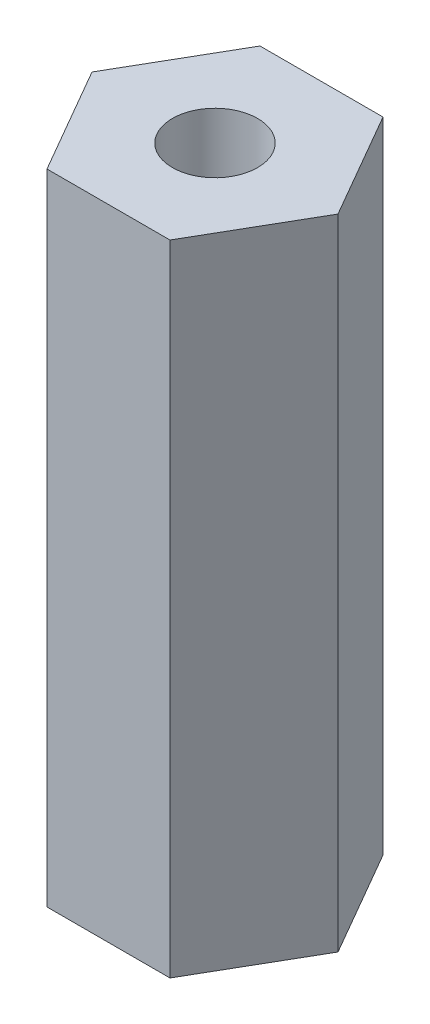
ISO-10303-21;
HEADER;
FILE_DESCRIPTION(('STEP AP214'),'2;1');
FILE_NAME('part.step','',(''),(''),'','','');
FILE_SCHEMA(('AUTOMOTIVE_DESIGN { 1 0 10303 214 1 1 1 1 }'));
ENDSEC;
DATA;
#1=APPLICATION_CONTEXT('core data for automotive mechanical design processes');
#2=APPLICATION_PROTOCOL_DEFINITION('international standard','automotive_design',2000,#1);
#3=PRODUCT_CONTEXT('',#1,'mechanical');
#4=PRODUCT('Part','Part','',(#3));
#5=PRODUCT_RELATED_PRODUCT_CATEGORY('part','',(#4));
#6=PRODUCT_DEFINITION_FORMATION('','',#4);
#7=PRODUCT_DEFINITION_CONTEXT('part definition',#1,'design');
#8=PRODUCT_DEFINITION('design','',#6,#7);
#9=PRODUCT_DEFINITION_SHAPE('','',#8);
#10=(LENGTH_UNIT() NAMED_UNIT(*) SI_UNIT(.MILLI.,.METRE.));
#11=(NAMED_UNIT(*) PLANE_ANGLE_UNIT() SI_UNIT($,.RADIAN.));
#12=(NAMED_UNIT(*) SI_UNIT($,.STERADIAN.) SOLID_ANGLE_UNIT());
#13=UNCERTAINTY_MEASURE_WITH_UNIT(LENGTH_MEASURE(1.E-05),#10,'distance_accuracy_value','');
#14=(GEOMETRIC_REPRESENTATION_CONTEXT(3) GLOBAL_UNCERTAINTY_ASSIGNED_CONTEXT((#13)) GLOBAL_UNIT_ASSIGNED_CONTEXT((#10,
#11,#12)) REPRESENTATION_CONTEXT('',''));
#15=CARTESIAN_POINT('',(0.,0.,0.));
#16=DIRECTION('',(0.,0.,1.));
#17=DIRECTION('',(1.,0.,0.));
#18=AXIS2_PLACEMENT_3D('',#15,#16,#17);
#19=CARTESIAN_POINT('',(1.443375673,15.,2.5));
#20=DIRECTION('',(-0.866025403838329,0.,-0.499999999906659));
#21=DIRECTION('',(-0.499999999906659,0.,0.866025403838329));
#22=AXIS2_PLACEMENT_3D('',#19,#20,#21);
#23=PLANE('',#22);
#24=DIRECTION('',(0.500000000006738,0.,-0.866025403780548));
#25=VECTOR('',#24,1.);
#26=CARTESIAN_POINT('',(1.443375673,15.,2.5));
#27=LINE('',#26,#25);
#28=CARTESIAN_POINT('',(1.443375673,15.,2.5));
#29=VERTEX_POINT('',#28);
#30=CARTESIAN_POINT('',(2.88675134585555,15.,-8.33995045868235E-11));
#31=VERTEX_POINT('',#30);
#32=EDGE_CURVE('E64',#29,#31,#27,.T.);
#33=ORIENTED_EDGE('',*,*,#32,.F.);
#34=DIRECTION('',(0.,1.,0.));
#35=VECTOR('',#34,1.);
#36=CARTESIAN_POINT('',(1.443375673,15.,2.5));
#37=LINE('',#36,#35);
#38=CARTESIAN_POINT('',(1.443375673,0.,2.5));
#39=VERTEX_POINT('',#38);
#40=EDGE_CURVE('E96',#39,#29,#37,.T.);
#41=ORIENTED_EDGE('',*,*,#40,.F.);
#42=DIRECTION('',(-0.500000000006738,0.,0.866025403780548));
#43=VECTOR('',#42,1.);
#44=CARTESIAN_POINT('',(2.886751346,0.,0.));
#45=LINE('',#44,#43);
#46=CARTESIAN_POINT('',(2.88675134585555,0.,-8.33993789826903E-11));
#47=VERTEX_POINT('',#46);
#48=EDGE_CURVE('E70',#47,#39,#45,.T.);
#49=ORIENTED_EDGE('',*,*,#48,.F.);
#50=DIRECTION('',(0.,1.,0.));
#51=VECTOR('',#50,1.);
#52=CARTESIAN_POINT('',(2.886751346,15.,0.));
#53=LINE('',#52,#51);
#54=EDGE_CURVE('E67',#31,#47,#53,.F.);
#55=ORIENTED_EDGE('',*,*,#54,.F.);
#56=EDGE_LOOP('',(#33,#41,#49,#55));
#57=FACE_BOUND('',#56,.T.);
#58=ADVANCED_FACE('F16',(#57),#23,.F.);
#59=CARTESIAN_POINT('',(-1.443375673,15.,2.5));
#60=DIRECTION('',(0.,0.,-1.));
#61=DIRECTION('',(-1.,0.,0.));
#62=AXIS2_PLACEMENT_3D('',#59,#60,#61);
#63=PLANE('',#62);
#64=DIRECTION('',(1.,0.,0.));
#65=VECTOR('',#64,1.);
#66=CARTESIAN_POINT('',(0.,15.,2.5));
#67=LINE('',#66,#65);
#68=CARTESIAN_POINT('',(-1.44337567314445,15.,2.5000000000834));
#69=VERTEX_POINT('',#68);
#70=EDGE_CURVE('E85',#69,#29,#67,.T.);
#71=ORIENTED_EDGE('',*,*,#70,.F.);
#72=DIRECTION('',(0.,1.,0.));
#73=VECTOR('',#72,1.);
#74=CARTESIAN_POINT('',(-1.4433756732889,15.,2.5000000001668));
#75=LINE('',#74,#73);
#76=CARTESIAN_POINT('',(-1.44337567307223,0.,2.5000000000417));
#77=VERTEX_POINT('',#76);
#78=EDGE_CURVE('E94',#77,#69,#75,.T.);
#79=ORIENTED_EDGE('',*,*,#78,.F.);
#80=DIRECTION('',(1.,0.,0.));
#81=VECTOR('',#80,1.);
#82=CARTESIAN_POINT('',(0.,0.,2.5));
#83=LINE('',#82,#81);
#84=EDGE_CURVE('E101',#39,#77,#83,.F.);
#85=ORIENTED_EDGE('',*,*,#84,.F.);
#86=ORIENTED_EDGE('',*,*,#40,.T.);
#87=EDGE_LOOP('',(#71,#79,#85,#86));
#88=FACE_BOUND('',#87,.T.);
#89=ADVANCED_FACE('F99',(#88),#63,.F.);
#90=CARTESIAN_POINT('',(-2.886751346,15.,0.));
#91=DIRECTION('',(0.866025403838329,0.,-0.499999999906659));
#92=DIRECTION('',(-0.499999999906659,0.,-0.866025403838329));
#93=AXIS2_PLACEMENT_3D('',#90,#91,#92);
#94=PLANE('',#93);
#95=DIRECTION('',(0.500000000006738,0.,0.866025403780548));
#96=VECTOR('',#95,1.);
#97=CARTESIAN_POINT('',(-2.886751346,15.,0.));
#98=LINE('',#97,#96);
#99=CARTESIAN_POINT('',(-2.88675134585555,15.,8.33995045868235E-11));
#100=VERTEX_POINT('',#99);
#101=EDGE_CURVE('E111',#100,#69,#98,.T.);
#102=ORIENTED_EDGE('',*,*,#101,.F.);
#103=DIRECTION('',(0.,1.,0.));
#104=VECTOR('',#103,1.);
#105=CARTESIAN_POINT('',(-2.8867513457111,15.,1.66798866385598E-10));
#106=LINE('',#105,#104);
#107=CARTESIAN_POINT('',(-2.88675134592777,0.,4.16996623862909E-11));
#108=VERTEX_POINT('',#107);
#109=EDGE_CURVE('E92',#108,#100,#106,.T.);
#110=ORIENTED_EDGE('',*,*,#109,.F.);
#111=DIRECTION('',(-0.500000000006738,0.,-0.866025403780548));
#112=VECTOR('',#111,1.);
#113=CARTESIAN_POINT('',(-1.443375673,0.,2.5));
#114=LINE('',#113,#112);
#115=EDGE_CURVE('E105',#77,#108,#114,.T.);
#116=ORIENTED_EDGE('',*,*,#115,.F.);
#117=ORIENTED_EDGE('',*,*,#78,.T.);
#118=EDGE_LOOP('',(#102,#110,#116,#117));
#119=FACE_BOUND('',#118,.T.);
#120=ADVANCED_FACE('F128',(#119),#94,.F.);
#121=CARTESIAN_POINT('',(-1.443375673,15.,-2.5));
#122=DIRECTION('',(0.866025403838329,0.,0.499999999906659));
#123=DIRECTION('',(0.499999999906659,0.,-0.866025403838329));
#124=AXIS2_PLACEMENT_3D('',#121,#122,#123);
#125=PLANE('',#124);
#126=DIRECTION('',(-0.500000000006738,0.,0.866025403780548));
#127=VECTOR('',#126,1.);
#128=CARTESIAN_POINT('',(-1.443375673,15.,-2.5));
#129=LINE('',#128,#127);
#130=CARTESIAN_POINT('',(-1.443375673,15.,-2.5));
#131=VERTEX_POINT('',#130);
#132=EDGE_CURVE('E116',#131,#100,#129,.T.);
#133=ORIENTED_EDGE('',*,*,#132,.F.);
#134=DIRECTION('',(0.,1.,0.));
#135=VECTOR('',#134,1.);
#136=CARTESIAN_POINT('',(-1.443375673,15.,-2.5));
#137=LINE('',#136,#135);
#138=CARTESIAN_POINT('',(-1.443375673,0.,-2.5));
#139=VERTEX_POINT('',#138);
#140=EDGE_CURVE('E90',#139,#131,#137,.T.);
#141=ORIENTED_EDGE('',*,*,#140,.F.);
#142=DIRECTION('',(0.500000000006738,0.,-0.866025403780548));
#143=VECTOR('',#142,1.);
#144=CARTESIAN_POINT('',(-2.886751346,0.,0.));
#145=LINE('',#144,#143);
#146=EDGE_CURVE('E126',#108,#139,#145,.T.);
#147=ORIENTED_EDGE('',*,*,#146,.F.);
#148=ORIENTED_EDGE('',*,*,#109,.T.);
#149=EDGE_LOOP('',(#133,#141,#147,#148));
#150=FACE_BOUND('',#149,.T.);
#151=ADVANCED_FACE('F124',(#150),#125,.F.);
#152=CARTESIAN_POINT('',(1.443375673,15.,-2.5));
#153=DIRECTION('',(0.,0.,1.));
#154=DIRECTION('',(1.,0.,0.));
#155=AXIS2_PLACEMENT_3D('',#152,#153,#154);
#156=PLANE('',#155);
#157=DIRECTION('',(1.,0.,0.));
#158=VECTOR('',#157,1.);
#159=CARTESIAN_POINT('',(0.,15.,-2.5));
#160=LINE('',#159,#158);
#161=CARTESIAN_POINT('',(1.44337567314445,15.,-2.5000000000834));
#162=VERTEX_POINT('',#161);
#163=EDGE_CURVE('E79',#162,#131,#160,.F.);
#164=ORIENTED_EDGE('',*,*,#163,.F.);
#165=DIRECTION('',(0.,1.,0.));
#166=VECTOR('',#165,1.);
#167=CARTESIAN_POINT('',(1.4433756732889,15.,-2.5000000001668));
#168=LINE('',#167,#166);
#169=CARTESIAN_POINT('',(1.44337567307223,0.,-2.5000000000417));
#170=VERTEX_POINT('',#169);
#171=EDGE_CURVE('E32',#170,#162,#168,.T.);
#172=ORIENTED_EDGE('',*,*,#171,.F.);
#173=DIRECTION('',(1.,0.,0.));
#174=VECTOR('',#173,1.);
#175=CARTESIAN_POINT('',(0.,0.,-2.5));
#176=LINE('',#175,#174);
#177=EDGE_CURVE('E120',#139,#170,#176,.T.);
#178=ORIENTED_EDGE('',*,*,#177,.F.);
#179=ORIENTED_EDGE('',*,*,#140,.T.);
#180=EDGE_LOOP('',(#164,#172,#178,#179));
#181=FACE_BOUND('',#180,.T.);
#182=ADVANCED_FACE('F119',(#181),#156,.F.);
#183=CARTESIAN_POINT('',(2.886751346,15.,0.));
#184=DIRECTION('',(-0.866025403838329,0.,0.499999999906659));
#185=DIRECTION('',(0.499999999906659,0.,0.866025403838329));
#186=AXIS2_PLACEMENT_3D('',#183,#184,#185);
#187=PLANE('',#186);
#188=DIRECTION('',(-0.500000000006738,0.,-0.866025403780548));
#189=VECTOR('',#188,1.);
#190=CARTESIAN_POINT('',(2.886751346,15.,0.));
#191=LINE('',#190,#189);
#192=EDGE_CURVE('E75',#31,#162,#191,.T.);
#193=ORIENTED_EDGE('',*,*,#192,.F.);
#194=ORIENTED_EDGE('',*,*,#54,.T.);
#195=DIRECTION('',(0.500000000006738,0.,0.866025403780548));
#196=VECTOR('',#195,1.);
#197=CARTESIAN_POINT('',(1.443375673,0.,-2.5));
#198=LINE('',#197,#196);
#199=EDGE_CURVE('E109',#170,#47,#198,.T.);
#200=ORIENTED_EDGE('',*,*,#199,.F.);
#201=ORIENTED_EDGE('',*,*,#171,.T.);
#202=EDGE_LOOP('',(#193,#194,#200,#201));
#203=FACE_BOUND('',#202,.T.);
#204=ADVANCED_FACE('F76',(#203),#187,.F.);
#205=CARTESIAN_POINT('',(0.,15.,0.));
#206=DIRECTION('',(0.,1.,0.));
#207=DIRECTION('',(0.,0.,1.));
#208=AXIS2_PLACEMENT_3D('',#205,#206,#207);
#209=PLANE('',#208);
#210=CARTESIAN_POINT('',(0.,15.,0.));
#211=DIRECTION('',(0.,-1.,0.));
#212=DIRECTION('',(1.,0.,0.));
#213=AXIS2_PLACEMENT_3D('',#210,#211,#212);
#214=CIRCLE('',#213,1.);
#215=CARTESIAN_POINT('',(1.,15.,0.));
#216=VERTEX_POINT('',#215);
#217=EDGE_CURVE('E19',#216,#216,#214,.F.);
#218=ORIENTED_EDGE('',*,*,#217,.F.);
#219=EDGE_LOOP('',(#218));
#220=FACE_BOUND('',#219,.T.);
#221=ORIENTED_EDGE('',*,*,#101,.T.);
#222=ORIENTED_EDGE('',*,*,#70,.T.);
#223=ORIENTED_EDGE('',*,*,#32,.T.);
#224=ORIENTED_EDGE('',*,*,#192,.T.);
#225=ORIENTED_EDGE('',*,*,#163,.T.);
#226=ORIENTED_EDGE('',*,*,#132,.T.);
#227=EDGE_LOOP('',(#221,#222,#223,#224,#225,#226));
#228=FACE_BOUND('',#227,.T.);
#229=ADVANCED_FACE('F83',(#220,#228),#209,.T.);
#230=CARTESIAN_POINT('',(0.,0.,0.));
#231=DIRECTION('',(0.,1.,0.));
#232=DIRECTION('',(0.,0.,1.));
#233=AXIS2_PLACEMENT_3D('',#230,#231,#232);
#234=PLANE('',#233);
#235=CARTESIAN_POINT('',(0.,0.,0.));
#236=DIRECTION('',(0.,-1.,0.));
#237=DIRECTION('',(1.,0.,0.));
#238=AXIS2_PLACEMENT_3D('',#235,#236,#237);
#239=CIRCLE('',#238,1.);
#240=CARTESIAN_POINT('',(0.999999999999987,0.,0.));
#241=VERTEX_POINT('',#240);
#242=EDGE_CURVE('E11',#241,#241,#239,.T.);
#243=ORIENTED_EDGE('',*,*,#242,.F.);
#244=EDGE_LOOP('',(#243));
#245=FACE_BOUND('',#244,.T.);
#246=ORIENTED_EDGE('',*,*,#177,.T.);
#247=ORIENTED_EDGE('',*,*,#199,.T.);
#248=ORIENTED_EDGE('',*,*,#48,.T.);
#249=ORIENTED_EDGE('',*,*,#84,.T.);
#250=ORIENTED_EDGE('',*,*,#115,.T.);
#251=ORIENTED_EDGE('',*,*,#146,.T.);
#252=EDGE_LOOP('',(#246,#247,#248,#249,#250,#251));
#253=FACE_BOUND('',#252,.T.);
#254=ADVANCED_FACE('F108',(#245,#253),#234,.F.);
#255=CARTESIAN_POINT('',(0.,15.,0.));
#256=DIRECTION('',(0.,-1.,0.));
#257=DIRECTION('',(1.,0.,0.));
#258=AXIS2_PLACEMENT_3D('',#255,#256,#257);
#259=CYLINDRICAL_SURFACE('',#258,1.);
#260=ORIENTED_EDGE('',*,*,#242,.T.);
#261=EDGE_LOOP('',(#260));
#262=FACE_BOUND('',#261,.T.);
#263=ORIENTED_EDGE('',*,*,#217,.T.);
#264=EDGE_LOOP('',(#263));
#265=FACE_BOUND('',#264,.T.);
#266=ADVANCED_FACE('F135',(#262,#265),#259,.F.);
#267=CLOSED_SHELL('',(#58,#89,#120,#151,#182,#204,#229,#254,#266));
#268=MANIFOLD_SOLID_BREP('B1',#267);
#269=ADVANCED_BREP_SHAPE_REPRESENTATION('',(#18,#268),#14);
#270=SHAPE_DEFINITION_REPRESENTATION(#9,#269);
ENDSEC;
END-ISO-10303-21;
